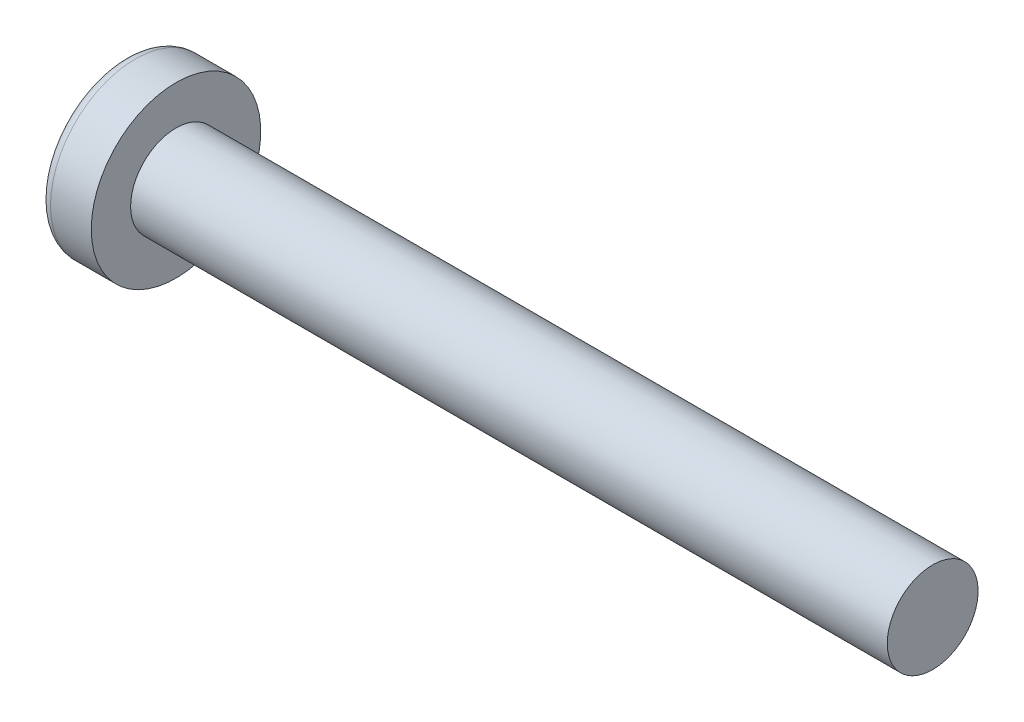
ISO-10303-21;
HEADER;
FILE_DESCRIPTION(('STEP AP214'),'2;1');
FILE_NAME('part.step','',(''),(''),'','','');
FILE_SCHEMA(('AUTOMOTIVE_DESIGN { 1 0 10303 214 1 1 1 1 }'));
ENDSEC;
DATA;
#1=APPLICATION_CONTEXT('core data for automotive mechanical design processes');
#2=APPLICATION_PROTOCOL_DEFINITION('international standard','automotive_design',2000,#1);
#3=PRODUCT_CONTEXT('',#1,'mechanical');
#4=PRODUCT('Part','Part','',(#3));
#5=PRODUCT_RELATED_PRODUCT_CATEGORY('part','',(#4));
#6=PRODUCT_DEFINITION_FORMATION('','',#4);
#7=PRODUCT_DEFINITION_CONTEXT('part definition',#1,'design');
#8=PRODUCT_DEFINITION('design','',#6,#7);
#9=PRODUCT_DEFINITION_SHAPE('','',#8);
#10=(LENGTH_UNIT() NAMED_UNIT(*) SI_UNIT(.MILLI.,.METRE.));
#11=(NAMED_UNIT(*) PLANE_ANGLE_UNIT() SI_UNIT($,.RADIAN.));
#12=(NAMED_UNIT(*) SI_UNIT($,.STERADIAN.) SOLID_ANGLE_UNIT());
#13=UNCERTAINTY_MEASURE_WITH_UNIT(LENGTH_MEASURE(1.E-05),#10,'distance_accuracy_value','');
#14=(GEOMETRIC_REPRESENTATION_CONTEXT(3) GLOBAL_UNCERTAINTY_ASSIGNED_CONTEXT((#13)) GLOBAL_UNIT_ASSIGNED_CONTEXT((#10,
#11,#12)) REPRESENTATION_CONTEXT('',''));
#15=CARTESIAN_POINT('',(0.,0.,0.));
#16=DIRECTION('',(0.,0.,1.));
#17=DIRECTION('',(1.,0.,0.));
#18=AXIS2_PLACEMENT_3D('',#15,#16,#17);
#19=CARTESIAN_POINT('',(5.,0.,0.));
#20=DIRECTION('',(-1.,0.,0.));
#21=DIRECTION('',(0.,1.,0.));
#22=AXIS2_PLACEMENT_3D('',#19,#20,#21);
#23=SPHERICAL_SURFACE('',#22,5.);
#24=CARTESIAN_POINT('',(0.74715070681048,0.,0.));
#25=DIRECTION('',(-1.,0.,0.));
#26=DIRECTION('',(0.,0.,1.));
#27=AXIS2_PLACEMENT_3D('',#24,#25,#26);
#28=CIRCLE('',#27,2.62931034482759);
#29=CARTESIAN_POINT('',(0.74715070681048,0.,2.62931034482759));
#30=VERTEX_POINT('',#29);
#31=EDGE_CURVE('E148',#30,#30,#28,.T.);
#32=ORIENTED_EDGE('',*,*,#31,.T.);
#33=EDGE_LOOP('',(#32));
#34=FACE_BOUND('',#33,.T.);
#35=CARTESIAN_POINT('',(4.98382636322272,-0.1538681120433,0.));
#36=DIRECTION('',(-0.104537710696287,-0.994520923380891,0.));
#37=DIRECTION('',(0.994520923380891,-0.104537710696287,0.));
#38=AXIS2_PLACEMENT_3D('',#35,#36,#37);
#39=CIRCLE('',#38,4.99760572850336);
#40=CARTESIAN_POINT('',(0.188596138461547,0.350175974082156,1.31444652548078));
#41=VERTEX_POINT('',#40);
#42=CARTESIAN_POINT('',(0.0270341343313642,0.367158343834488,0.367158343834495));
#43=VERTEX_POINT('',#42);
#44=EDGE_CURVE('E123',#41,#43,#39,.T.);
#45=ORIENTED_EDGE('',*,*,#44,.F.);
#46=CARTESIAN_POINT('',(3.98403090792016,0.,-1.4135222150676));
#47=DIRECTION('',(0.583636048152575,0.,0.812015371342714));
#48=DIRECTION('',(0.812015371342714,0.,-0.583636048152575));
#49=AXIS2_PLACEMENT_3D('',#46,#47,#48);
#50=CIRCLE('',#49,4.68719124331927);
#51=CARTESIAN_POINT('',(0.188596138461547,-0.35017597408217,1.31444652548077));
#52=VERTEX_POINT('',#51);
#53=EDGE_CURVE('E116',#41,#52,#50,.T.);
#54=ORIENTED_EDGE('',*,*,#53,.T.);
#55=CARTESIAN_POINT('',(4.98382636322272,0.153868112043293,0.));
#56=DIRECTION('',(-0.104537710696287,0.994520923380891,0.));
#57=DIRECTION('',(-0.994520923380891,-0.104537710696287,0.));
#58=AXIS2_PLACEMENT_3D('',#55,#56,#57);
#59=CIRCLE('',#58,4.99760572850336);
#60=CARTESIAN_POINT('',(0.0270341343313607,-0.367158343834481,0.367158343834495));
#61=VERTEX_POINT('',#60);
#62=EDGE_CURVE('E189',#61,#52,#59,.T.);
#63=ORIENTED_EDGE('',*,*,#62,.F.);
#64=CARTESIAN_POINT('',(4.98382636322272,0.,-0.153868112043293));
#65=DIRECTION('',(-0.104537710696287,0.,-0.994520923380891));
#66=DIRECTION('',(-0.994520923380891,0.,0.104537710696287));
#67=AXIS2_PLACEMENT_3D('',#64,#65,#66);
#68=CIRCLE('',#67,4.99760572850336);
#69=CARTESIAN_POINT('',(0.188596138461544,-1.31444652548077,0.35017597408217));
#70=VERTEX_POINT('',#69);
#71=EDGE_CURVE('E164',#70,#61,#68,.T.);
#72=ORIENTED_EDGE('',*,*,#71,.F.);
#73=CARTESIAN_POINT('',(3.98403090792016,1.41352221506761,0.));
#74=DIRECTION('',(0.583636048152575,-0.812015371342714,0.));
#75=DIRECTION('',(0.812015371342714,0.583636048152575,0.));
#76=AXIS2_PLACEMENT_3D('',#73,#74,#75);
#77=CIRCLE('',#76,4.68719124331927);
#78=CARTESIAN_POINT('',(0.188596138461544,-1.31444652548077,-0.35017597408217));
#79=VERTEX_POINT('',#78);
#80=EDGE_CURVE('E160',#70,#79,#77,.T.);
#81=ORIENTED_EDGE('',*,*,#80,.T.);
#82=CARTESIAN_POINT('',(4.98382636322272,0.,0.153868112043293));
#83=DIRECTION('',(-0.104537710696287,0.,0.994520923380891));
#84=DIRECTION('',(0.994520923380891,0.,0.104537710696287));
#85=AXIS2_PLACEMENT_3D('',#82,#83,#84);
#86=CIRCLE('',#85,4.99760572850336);
#87=CARTESIAN_POINT('',(0.0270341343313607,-0.367158343834481,-0.367158343834495));
#88=VERTEX_POINT('',#87);
#89=EDGE_CURVE('E44',#88,#79,#86,.T.);
#90=ORIENTED_EDGE('',*,*,#89,.F.);
#91=CARTESIAN_POINT('',(0.188596138461544,-0.350175974082163,-1.31444652548077));
#92=VERTEX_POINT('',#91);
#93=EDGE_CURVE('E186',#92,#88,#59,.T.);
#94=ORIENTED_EDGE('',*,*,#93,.F.);
#95=CARTESIAN_POINT('',(3.98403090792016,0.,1.41352221506762));
#96=DIRECTION('',(0.583636048152575,0.,-0.812015371342714));
#97=DIRECTION('',(-0.812015371342714,0.,-0.583636048152575));
#98=AXIS2_PLACEMENT_3D('',#95,#96,#97);
#99=CIRCLE('',#98,4.68719124331927);
#100=CARTESIAN_POINT('',(0.188596138461544,0.35017597408217,-1.31444652548077));
#101=VERTEX_POINT('',#100);
#102=EDGE_CURVE('E179',#92,#101,#99,.T.);
#103=ORIENTED_EDGE('',*,*,#102,.T.);
#104=CARTESIAN_POINT('',(0.0270341343313607,0.367158343834488,-0.367158343834481));
#105=VERTEX_POINT('',#104);
#106=EDGE_CURVE('E101',#105,#101,#39,.T.);
#107=ORIENTED_EDGE('',*,*,#106,.F.);
#108=CARTESIAN_POINT('',(0.188596138461547,1.31444652548076,-0.35017597408217));
#109=VERTEX_POINT('',#108);
#110=EDGE_CURVE('E37',#109,#105,#86,.T.);
#111=ORIENTED_EDGE('',*,*,#110,.F.);
#112=CARTESIAN_POINT('',(3.98403090792016,-1.41352221506761,0.));
#113=DIRECTION('',(0.583636048152575,0.812015371342714,0.));
#114=DIRECTION('',(-0.812015371342714,0.583636048152575,0.));
#115=AXIS2_PLACEMENT_3D('',#112,#113,#114);
#116=CIRCLE('',#115,4.68719124331927);
#117=CARTESIAN_POINT('',(0.188596138461547,1.31444652548077,0.35017597408217));
#118=VERTEX_POINT('',#117);
#119=EDGE_CURVE('E11',#109,#118,#116,.T.);
#120=ORIENTED_EDGE('',*,*,#119,.T.);
#121=EDGE_CURVE('E163',#43,#118,#68,.T.);
#122=ORIENTED_EDGE('',*,*,#121,.F.);
#123=EDGE_LOOP('',(#45,#54,#63,#72,#81,#90,#94,#103,#107,#111,#120,#122));
#124=FACE_BOUND('',#123,.T.);
#125=ADVANCED_FACE('F29',(#34,#124),#23,.T.);
#126=CARTESIAN_POINT('',(2.01739130434783,0.,-0.157944664031628));
#127=DIRECTION('',(-0.104537710696287,0.,0.994520923380891));
#128=DIRECTION('',(0.994520923380891,0.,0.104537710696287));
#129=AXIS2_PLACEMENT_3D('',#126,#127,#128);
#130=PLANE('',#129);
#131=ORIENTED_EDGE('',*,*,#110,.T.);
#132=DIRECTION('',(0.989130931836555,-0.103971149085093,0.103971149085092));
#133=VECTOR('',#132,1.);
#134=CARTESIAN_POINT('',(2.03363450411053,0.156237282238382,-0.156237282238375));
#135=LINE('',#134,#133);
#136=CARTESIAN_POINT('',(1.76,0.185000000000005,-0.185000000000005));
#137=VERTEX_POINT('',#136);
#138=EDGE_CURVE('E99',#105,#137,#135,.T.);
#139=ORIENTED_EDGE('',*,*,#138,.T.);
#140=DIRECTION('',(0.80907355338853,-0.581521616498006,0.0850446632823171));
#141=VECTOR('',#140,1.);
#142=CARTESIAN_POINT('',(0.,1.45000000000001,-0.369999999999995));
#143=LINE('',#142,#141);
#144=EDGE_CURVE('E121',#109,#137,#143,.T.);
#145=ORIENTED_EDGE('',*,*,#144,.F.);
#146=EDGE_LOOP('',(#131,#139,#145));
#147=FACE_BOUND('',#146,.T.);
#148=ADVANCED_FACE('F120',(#147),#130,.T.);
#149=DIRECTION('',(0.80907355338853,0.581521616498006,0.0850446632823171));
#150=VECTOR('',#149,1.);
#151=CARTESIAN_POINT('',(0.,-1.44999999999999,-0.370000000000009));
#152=LINE('',#151,#150);
#153=CARTESIAN_POINT('',(1.76,-0.184999999999998,-0.185000000000005));
#154=VERTEX_POINT('',#153);
#155=EDGE_CURVE('E142',#79,#154,#152,.T.);
#156=ORIENTED_EDGE('',*,*,#155,.T.);
#157=DIRECTION('',(-0.989130931836555,-0.103971149085092,-0.103971149085092));
#158=VECTOR('',#157,1.);
#159=CARTESIAN_POINT('',(2.03363450411053,-0.156237282238375,-0.156237282238389));
#160=LINE('',#159,#158);
#161=EDGE_CURVE('E187',#154,#88,#160,.T.);
#162=ORIENTED_EDGE('',*,*,#161,.T.);
#163=ORIENTED_EDGE('',*,*,#89,.T.);
#164=EDGE_LOOP('',(#156,#162,#163));
#165=FACE_BOUND('',#164,.T.);
#166=ADVANCED_FACE('F220',(#165),#130,.T.);
#167=CARTESIAN_POINT('',(2.01739130434783,0.,0.157944664031628));
#168=DIRECTION('',(-0.104537710696287,0.,-0.994520923380891));
#169=DIRECTION('',(-0.994520923380891,0.,0.104537710696287));
#170=AXIS2_PLACEMENT_3D('',#167,#168,#169);
#171=PLANE('',#170);
#172=DIRECTION('',(0.80907355338853,-0.581521616498006,-0.0850446632823171));
#173=VECTOR('',#172,1.);
#174=CARTESIAN_POINT('',(0.,1.44999999999999,0.370000000000009));
#175=LINE('',#174,#173);
#176=CARTESIAN_POINT('',(1.76,0.184999999999998,0.185000000000005));
#177=VERTEX_POINT('',#176);
#178=EDGE_CURVE('E128',#118,#177,#175,.T.);
#179=ORIENTED_EDGE('',*,*,#178,.T.);
#180=DIRECTION('',(-0.989130931836555,0.103971149085092,0.103971149085092));
#181=VECTOR('',#180,1.);
#182=CARTESIAN_POINT('',(2.03363450411053,0.156237282238389,0.156237282238389));
#183=LINE('',#182,#181);
#184=EDGE_CURVE('E175',#177,#43,#183,.T.);
#185=ORIENTED_EDGE('',*,*,#184,.T.);
#186=ORIENTED_EDGE('',*,*,#121,.T.);
#187=EDGE_LOOP('',(#179,#185,#186));
#188=FACE_BOUND('',#187,.T.);
#189=ADVANCED_FACE('F173',(#188),#171,.T.);
#190=ORIENTED_EDGE('',*,*,#71,.T.);
#191=DIRECTION('',(0.989130931836555,0.103971149085093,-0.103971149085092));
#192=VECTOR('',#191,1.);
#193=CARTESIAN_POINT('',(2.03363450411053,-0.156237282238382,0.156237282238389));
#194=LINE('',#193,#192);
#195=CARTESIAN_POINT('',(1.76,-0.184999999999998,0.185000000000005));
#196=VERTEX_POINT('',#195);
#197=EDGE_CURVE('E192',#61,#196,#194,.T.);
#198=ORIENTED_EDGE('',*,*,#197,.T.);
#199=DIRECTION('',(0.80907355338853,0.581521616498006,-0.0850446632823169));
#200=VECTOR('',#199,1.);
#201=CARTESIAN_POINT('',(0.,-1.45,0.370000000000009));
#202=LINE('',#201,#200);
#203=EDGE_CURVE('E139',#70,#196,#202,.T.);
#204=ORIENTED_EDGE('',*,*,#203,.F.);
#205=EDGE_LOOP('',(#190,#198,#204));
#206=FACE_BOUND('',#205,.T.);
#207=ADVANCED_FACE('F239',(#206),#171,.T.);
#208=CARTESIAN_POINT('',(-25.4,0.,0.));
#209=DIRECTION('',(-1.,0.,0.));
#210=DIRECTION('',(0.,0.,1.));
#211=AXIS2_PLACEMENT_3D('',#208,#209,#210);
#212=CYLINDRICAL_SURFACE('',#211,1.5);
#213=CARTESIAN_POINT('',(27.4,0.,0.));
#214=DIRECTION('',(-1.,0.,0.));
#215=DIRECTION('',(0.,0.,1.));
#216=AXIS2_PLACEMENT_3D('',#213,#214,#215);
#217=CIRCLE('',#216,1.5);
#218=CARTESIAN_POINT('',(27.4,0.,1.5));
#219=VERTEX_POINT('',#218);
#220=EDGE_CURVE('E127',#219,#219,#217,.T.);
#221=ORIENTED_EDGE('',*,*,#220,.T.);
#222=EDGE_LOOP('',(#221));
#223=FACE_BOUND('',#222,.T.);
#224=CARTESIAN_POINT('',(2.4,0.,0.));
#225=DIRECTION('',(-1.,0.,0.));
#226=DIRECTION('',(0.,0.,1.));
#227=AXIS2_PLACEMENT_3D('',#224,#225,#226);
#228=CIRCLE('',#227,1.5);
#229=CARTESIAN_POINT('',(2.4,0.,1.5));
#230=VERTEX_POINT('',#229);
#231=EDGE_CURVE('E157',#230,#230,#228,.T.);
#232=ORIENTED_EDGE('',*,*,#231,.F.);
#233=EDGE_LOOP('',(#232));
#234=FACE_BOUND('',#233,.T.);
#235=ADVANCED_FACE('F31',(#223,#234),#212,.T.);
#236=CARTESIAN_POINT('',(2.4,1.49999999999999,0.));
#237=DIRECTION('',(-1.,0.,0.));
#238=DIRECTION('',(0.,0.,1.));
#239=AXIS2_PLACEMENT_3D('',#236,#237,#238);
#240=PLANE('',#239);
#241=CARTESIAN_POINT('',(2.4,0.,0.));
#242=DIRECTION('',(-1.,0.,0.));
#243=DIRECTION('',(0.,0.,1.));
#244=AXIS2_PLACEMENT_3D('',#241,#242,#243);
#245=CIRCLE('',#244,2.8);
#246=CARTESIAN_POINT('',(2.4,0.,2.8));
#247=VERTEX_POINT('',#246);
#248=EDGE_CURVE('E154',#247,#247,#245,.T.);
#249=ORIENTED_EDGE('',*,*,#248,.F.);
#250=EDGE_LOOP('',(#249));
#251=FACE_BOUND('',#250,.T.);
#252=ORIENTED_EDGE('',*,*,#231,.T.);
#253=EDGE_LOOP('',(#252));
#254=FACE_BOUND('',#253,.T.);
#255=ADVANCED_FACE('F232',(#251,#254),#240,.F.);
#256=CARTESIAN_POINT('',(-25.4,0.,0.));
#257=DIRECTION('',(-1.,0.,0.));
#258=DIRECTION('',(0.,0.,1.));
#259=AXIS2_PLACEMENT_3D('',#256,#257,#258);
#260=CYLINDRICAL_SURFACE('',#259,2.8);
#261=ORIENTED_EDGE('',*,*,#248,.T.);
#262=EDGE_LOOP('',(#261));
#263=FACE_BOUND('',#262,.T.);
#264=CARTESIAN_POINT('',(1.05335585592013,0.,0.));
#265=DIRECTION('',(-1.,0.,0.));
#266=DIRECTION('',(0.,0.,1.));
#267=AXIS2_PLACEMENT_3D('',#264,#265,#266);
#268=CIRCLE('',#267,2.8);
#269=CARTESIAN_POINT('',(1.05335585592013,0.,2.8));
#270=VERTEX_POINT('',#269);
#271=EDGE_CURVE('E151',#270,#270,#268,.T.);
#272=ORIENTED_EDGE('',*,*,#271,.F.);
#273=EDGE_LOOP('',(#272));
#274=FACE_BOUND('',#273,.T.);
#275=ADVANCED_FACE('F229',(#263,#274),#260,.T.);
#276=CARTESIAN_POINT('',(1.05335585592013,0.,0.));
#277=DIRECTION('',(-1.,0.,0.));
#278=DIRECTION('',(0.,0.,1.));
#279=AXIS2_PLACEMENT_3D('',#276,#277,#278);
#280=TOROIDAL_SURFACE('',#279,2.44,0.36);
#281=ORIENTED_EDGE('',*,*,#271,.T.);
#282=EDGE_LOOP('',(#281));
#283=FACE_BOUND('',#282,.T.);
#284=ORIENTED_EDGE('',*,*,#31,.F.);
#285=EDGE_LOOP('',(#284));
#286=FACE_BOUND('',#285,.T.);
#287=ADVANCED_FACE('F226',(#283,#286),#280,.T.);
#288=CARTESIAN_POINT('',(27.4,1.5,0.));
#289=DIRECTION('',(1.,0.,0.));
#290=DIRECTION('',(0.,0.,-1.));
#291=AXIS2_PLACEMENT_3D('',#288,#289,#290);
#292=PLANE('',#291);
#293=ORIENTED_EDGE('',*,*,#220,.F.);
#294=EDGE_LOOP('',(#293));
#295=FACE_BOUND('',#294,.T.);
#296=ADVANCED_FACE('F224',(#295),#292,.T.);
#297=CARTESIAN_POINT('',(1.76,0.184999999999998,0.185000000000005));
#298=DIRECTION('',(0.583636048152575,0.812015371342714,0.));
#299=DIRECTION('',(-0.812015371342714,0.583636048152575,0.));
#300=AXIS2_PLACEMENT_3D('',#297,#298,#299);
#301=PLANE('',#300);
#302=ORIENTED_EDGE('',*,*,#144,.T.);
#303=DIRECTION('',(0.,0.,-1.));
#304=VECTOR('',#303,1.);
#305=CARTESIAN_POINT('',(1.76,0.184999999999998,0.185000000000005));
#306=LINE('',#305,#304);
#307=EDGE_CURVE('E115',#177,#137,#306,.T.);
#308=ORIENTED_EDGE('',*,*,#307,.F.);
#309=ORIENTED_EDGE('',*,*,#178,.F.);
#310=ORIENTED_EDGE('',*,*,#119,.F.);
#311=EDGE_LOOP('',(#302,#308,#309,#310));
#312=FACE_BOUND('',#311,.T.);
#313=ADVANCED_FACE('F126',(#312),#301,.F.);
#314=CARTESIAN_POINT('',(1.76,-0.184999999999998,-0.185000000000005));
#315=DIRECTION('',(0.583636048152575,-0.812015371342714,0.));
#316=DIRECTION('',(0.812015371342714,0.583636048152575,0.));
#317=AXIS2_PLACEMENT_3D('',#314,#315,#316);
#318=PLANE('',#317);
#319=ORIENTED_EDGE('',*,*,#203,.T.);
#320=DIRECTION('',(0.,0.,1.));
#321=VECTOR('',#320,1.);
#322=CARTESIAN_POINT('',(1.76,-0.184999999999998,-0.185000000000005));
#323=LINE('',#322,#321);
#324=EDGE_CURVE('E135',#154,#196,#323,.T.);
#325=ORIENTED_EDGE('',*,*,#324,.F.);
#326=ORIENTED_EDGE('',*,*,#155,.F.);
#327=ORIENTED_EDGE('',*,*,#80,.F.);
#328=EDGE_LOOP('',(#319,#325,#326,#327));
#329=FACE_BOUND('',#328,.T.);
#330=ADVANCED_FACE('F259',(#329),#318,.F.);
#331=CARTESIAN_POINT('',(1.76,-0.184999999999998,-0.185000000000005));
#332=DIRECTION('',(1.,0.,0.));
#333=DIRECTION('',(0.,0.,-1.));
#334=AXIS2_PLACEMENT_3D('',#331,#332,#333);
#335=PLANE('',#334);
#336=DIRECTION('',(0.,1.,0.));
#337=VECTOR('',#336,1.);
#338=CARTESIAN_POINT('',(1.76,-0.184999999999998,-0.185000000000005));
#339=LINE('',#338,#337);
#340=EDGE_CURVE('E108',#154,#137,#339,.T.);
#341=ORIENTED_EDGE('',*,*,#340,.F.);
#342=ORIENTED_EDGE('',*,*,#324,.T.);
#343=DIRECTION('',(0.,-1.,0.));
#344=VECTOR('',#343,1.);
#345=CARTESIAN_POINT('',(1.76,0.184999999999998,0.185000000000005));
#346=LINE('',#345,#344);
#347=EDGE_CURVE('E133',#177,#196,#346,.T.);
#348=ORIENTED_EDGE('',*,*,#347,.F.);
#349=ORIENTED_EDGE('',*,*,#307,.T.);
#350=EDGE_LOOP('',(#341,#342,#348,#349));
#351=FACE_BOUND('',#350,.T.);
#352=ADVANCED_FACE('F131',(#351),#335,.F.);
#353=CARTESIAN_POINT('',(1.76,0.185000000000005,-0.185000000000005));
#354=DIRECTION('',(0.583636048152575,0.,-0.812015371342714));
#355=DIRECTION('',(0.812015371342714,0.,0.583636048152575));
#356=AXIS2_PLACEMENT_3D('',#353,#354,#355);
#357=PLANE('',#356);
#358=DIRECTION('',(0.809073553388531,0.0850446632823148,0.581521616498007));
#359=VECTOR('',#358,1.);
#360=CARTESIAN_POINT('',(0.,-0.369999999999995,-1.44999999999999));
#361=LINE('',#360,#359);
#362=EDGE_CURVE('E105',#92,#154,#361,.T.);
#363=ORIENTED_EDGE('',*,*,#362,.T.);
#364=ORIENTED_EDGE('',*,*,#340,.T.);
#365=DIRECTION('',(0.80907355338853,-0.0850446632823192,0.581521616498006));
#366=VECTOR('',#365,1.);
#367=CARTESIAN_POINT('',(0.,0.370000000000002,-1.44999999999999));
#368=LINE('',#367,#366);
#369=EDGE_CURVE('E95',#101,#137,#368,.T.);
#370=ORIENTED_EDGE('',*,*,#369,.F.);
#371=ORIENTED_EDGE('',*,*,#102,.F.);
#372=EDGE_LOOP('',(#363,#364,#370,#371));
#373=FACE_BOUND('',#372,.T.);
#374=ADVANCED_FACE('F109',(#373),#357,.F.);
#375=CARTESIAN_POINT('',(2.01739130434783,-0.157944664031621,0.));
#376=DIRECTION('',(-0.104537710696287,0.994520923380891,0.));
#377=DIRECTION('',(-0.994520923380891,-0.104537710696287,0.));
#378=AXIS2_PLACEMENT_3D('',#375,#376,#377);
#379=PLANE('',#378);
#380=ORIENTED_EDGE('',*,*,#93,.T.);
#381=ORIENTED_EDGE('',*,*,#161,.F.);
#382=ORIENTED_EDGE('',*,*,#362,.F.);
#383=EDGE_LOOP('',(#380,#381,#382));
#384=FACE_BOUND('',#383,.T.);
#385=ADVANCED_FACE('F211',(#384),#379,.T.);
#386=CARTESIAN_POINT('',(2.01739130434783,0.157944664031621,0.));
#387=DIRECTION('',(-0.104537710696287,-0.994520923380891,0.));
#388=DIRECTION('',(0.994520923380891,-0.104537710696287,0.));
#389=AXIS2_PLACEMENT_3D('',#386,#387,#388);
#390=PLANE('',#389);
#391=ORIENTED_EDGE('',*,*,#106,.T.);
#392=ORIENTED_EDGE('',*,*,#369,.T.);
#393=ORIENTED_EDGE('',*,*,#138,.F.);
#394=EDGE_LOOP('',(#391,#392,#393));
#395=FACE_BOUND('',#394,.T.);
#396=ADVANCED_FACE('F97',(#395),#390,.T.);
#397=CARTESIAN_POINT('',(1.76,-0.184999999999998,0.185000000000005));
#398=DIRECTION('',(0.583636048152575,0.,0.812015371342714));
#399=DIRECTION('',(-0.812015371342714,0.,0.583636048152575));
#400=AXIS2_PLACEMENT_3D('',#397,#398,#399);
#401=PLANE('',#400);
#402=DIRECTION('',(0.80907355338853,-0.0850446632823151,-0.581521616498007));
#403=VECTOR('',#402,1.);
#404=CARTESIAN_POINT('',(0.,0.369999999999995,1.45000000000001));
#405=LINE('',#404,#403);
#406=EDGE_CURVE('E195',#41,#177,#405,.T.);
#407=ORIENTED_EDGE('',*,*,#406,.T.);
#408=ORIENTED_EDGE('',*,*,#347,.T.);
#409=DIRECTION('',(0.80907355338853,0.085044663282319,-0.581521616498006));
#410=VECTOR('',#409,1.);
#411=CARTESIAN_POINT('',(0.,-0.370000000000002,1.44999999999999));
#412=LINE('',#411,#410);
#413=EDGE_CURVE('E104',#52,#196,#412,.T.);
#414=ORIENTED_EDGE('',*,*,#413,.F.);
#415=ORIENTED_EDGE('',*,*,#53,.F.);
#416=EDGE_LOOP('',(#407,#408,#414,#415));
#417=FACE_BOUND('',#416,.T.);
#418=ADVANCED_FACE('F199',(#417),#401,.F.);
#419=ORIENTED_EDGE('',*,*,#44,.T.);
#420=ORIENTED_EDGE('',*,*,#184,.F.);
#421=ORIENTED_EDGE('',*,*,#406,.F.);
#422=EDGE_LOOP('',(#419,#420,#421));
#423=FACE_BOUND('',#422,.T.);
#424=ADVANCED_FACE('F201',(#423),#390,.T.);
#425=ORIENTED_EDGE('',*,*,#62,.T.);
#426=ORIENTED_EDGE('',*,*,#413,.T.);
#427=ORIENTED_EDGE('',*,*,#197,.F.);
#428=EDGE_LOOP('',(#425,#426,#427));
#429=FACE_BOUND('',#428,.T.);
#430=ADVANCED_FACE('F203',(#429),#379,.T.);
#431=CLOSED_SHELL('',(#125,#148,#166,#189,#207,#235,#255,#275,#287,#296,#313,#330,#352,#374,
#385,#396,#418,#424,#430));
#432=MANIFOLD_SOLID_BREP('B2',#431);
#433=ADVANCED_BREP_SHAPE_REPRESENTATION('',(#18,#432),#14);
#434=SHAPE_DEFINITION_REPRESENTATION(#9,#433);
ENDSEC;
END-ISO-10303-21;
